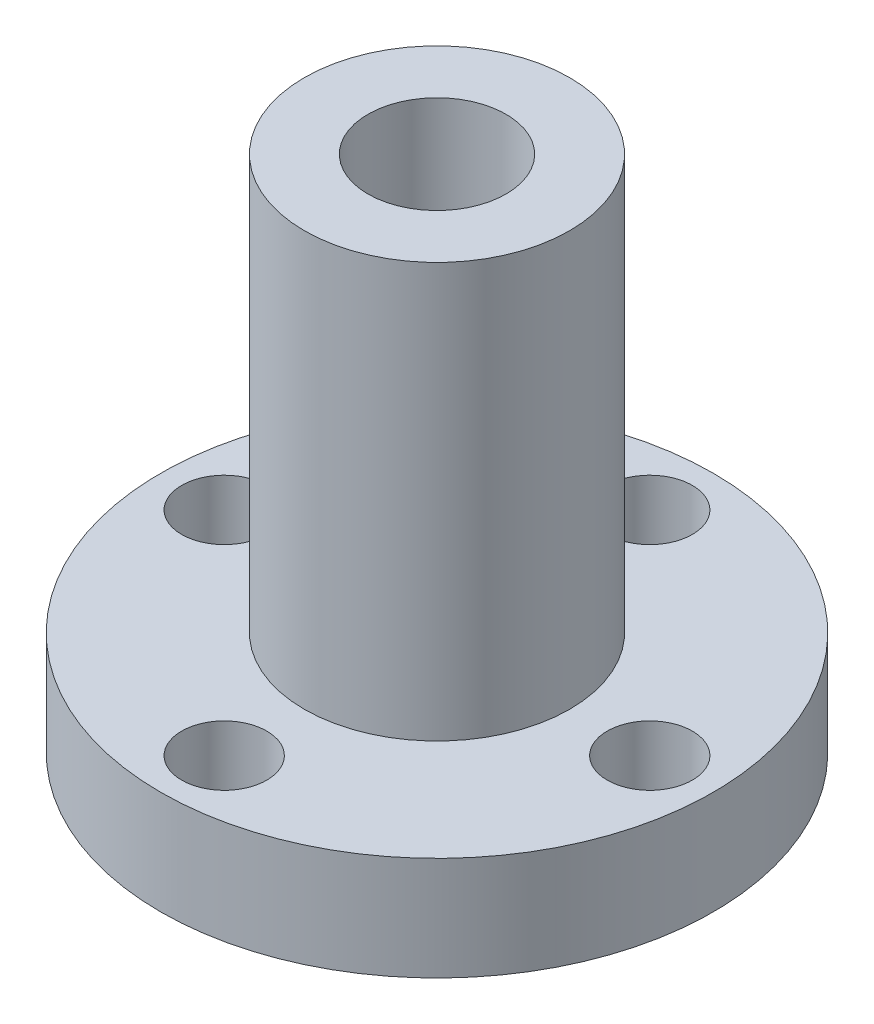
ISO-10303-21;
HEADER;
FILE_DESCRIPTION(('STEP AP214'),'2;1');
FILE_NAME('part.step','',(''),(''),'','','');
FILE_SCHEMA(('AUTOMOTIVE_DESIGN { 1 0 10303 214 1 1 1 1 }'));
ENDSEC;
DATA;
#1=APPLICATION_CONTEXT('core data for automotive mechanical design processes');
#2=APPLICATION_PROTOCOL_DEFINITION('international standard','automotive_design',2000,#1);
#3=PRODUCT_CONTEXT('',#1,'mechanical');
#4=PRODUCT('Part','Part','',(#3));
#5=PRODUCT_RELATED_PRODUCT_CATEGORY('part','',(#4));
#6=PRODUCT_DEFINITION_FORMATION('','',#4);
#7=PRODUCT_DEFINITION_CONTEXT('part definition',#1,'design');
#8=PRODUCT_DEFINITION('design','',#6,#7);
#9=PRODUCT_DEFINITION_SHAPE('','',#8);
#10=(LENGTH_UNIT() NAMED_UNIT(*) SI_UNIT(.MILLI.,.METRE.));
#11=(NAMED_UNIT(*) PLANE_ANGLE_UNIT() SI_UNIT($,.RADIAN.));
#12=(NAMED_UNIT(*) SI_UNIT($,.STERADIAN.) SOLID_ANGLE_UNIT());
#13=UNCERTAINTY_MEASURE_WITH_UNIT(LENGTH_MEASURE(1.E-05),#10,'distance_accuracy_value','');
#14=(GEOMETRIC_REPRESENTATION_CONTEXT(3) GLOBAL_UNCERTAINTY_ASSIGNED_CONTEXT((#13)) GLOBAL_UNIT_ASSIGNED_CONTEXT((#10,
#11,#12)) REPRESENTATION_CONTEXT('',''));
#15=CARTESIAN_POINT('',(0.,0.,0.));
#16=DIRECTION('',(0.,0.,1.));
#17=DIRECTION('',(1.,0.,0.));
#18=AXIS2_PLACEMENT_3D('',#15,#16,#17);
#19=CARTESIAN_POINT('',(0.,-4.7625,0.));
#20=DIRECTION('',(0.,1.,0.));
#21=DIRECTION('',(0.,0.,1.));
#22=AXIS2_PLACEMENT_3D('',#19,#20,#21);
#23=CYLINDRICAL_SURFACE('',#22,12.7);
#24=CARTESIAN_POINT('',(0.,-4.7625,0.));
#25=DIRECTION('',(0.,1.,0.));
#26=DIRECTION('',(0.,0.,1.));
#27=AXIS2_PLACEMENT_3D('',#24,#25,#26);
#28=CIRCLE('',#27,12.7);
#29=CARTESIAN_POINT('',(0.,-4.7625,12.7));
#30=VERTEX_POINT('',#29);
#31=EDGE_CURVE('E42',#30,#30,#28,.T.);
#32=ORIENTED_EDGE('',*,*,#31,.T.);
#33=EDGE_LOOP('',(#32));
#34=FACE_BOUND('',#33,.T.);
#35=CARTESIAN_POINT('',(0.,0.,0.));
#36=DIRECTION('',(0.,1.,0.));
#37=DIRECTION('',(0.,0.,1.));
#38=AXIS2_PLACEMENT_3D('',#35,#36,#37);
#39=CIRCLE('',#38,12.7);
#40=CARTESIAN_POINT('',(0.,0.,12.7));
#41=VERTEX_POINT('',#40);
#42=EDGE_CURVE('E38',#41,#41,#39,.T.);
#43=ORIENTED_EDGE('',*,*,#42,.F.);
#44=EDGE_LOOP('',(#43));
#45=FACE_BOUND('',#44,.T.);
#46=ADVANCED_FACE('F34',(#34,#45),#23,.T.);
#47=CARTESIAN_POINT('',(0.,-4.7625,-9.779));
#48=DIRECTION('',(0.,1.,0.));
#49=DIRECTION('',(0.,0.,1.));
#50=AXIS2_PLACEMENT_3D('',#47,#48,#49);
#51=CYLINDRICAL_SURFACE('',#50,1.9558);
#52=CARTESIAN_POINT('',(0.,-4.7625,-9.779));
#53=DIRECTION('',(0.,1.,0.));
#54=DIRECTION('',(0.,0.,1.));
#55=AXIS2_PLACEMENT_3D('',#52,#53,#54);
#56=CIRCLE('',#55,1.9558);
#57=CARTESIAN_POINT('',(0.,-4.7625,-7.8232));
#58=VERTEX_POINT('',#57);
#59=EDGE_CURVE('E47',#58,#58,#56,.T.);
#60=ORIENTED_EDGE('',*,*,#59,.F.);
#61=EDGE_LOOP('',(#60));
#62=FACE_BOUND('',#61,.T.);
#63=CARTESIAN_POINT('',(0.,0.,-9.779));
#64=DIRECTION('',(0.,1.,0.));
#65=DIRECTION('',(0.,0.,1.));
#66=AXIS2_PLACEMENT_3D('',#63,#64,#65);
#67=CIRCLE('',#66,1.9558);
#68=CARTESIAN_POINT('',(0.,0.,-7.8232));
#69=VERTEX_POINT('',#68);
#70=EDGE_CURVE('E60',#69,#69,#67,.T.);
#71=ORIENTED_EDGE('',*,*,#70,.T.);
#72=EDGE_LOOP('',(#71));
#73=FACE_BOUND('',#72,.T.);
#74=ADVANCED_FACE('F87',(#62,#73),#51,.F.);
#75=CARTESIAN_POINT('',(9.779,-4.7625,0.));
#76=DIRECTION('',(0.,1.,0.));
#77=DIRECTION('',(0.,0.,1.));
#78=AXIS2_PLACEMENT_3D('',#75,#76,#77);
#79=CYLINDRICAL_SURFACE('',#78,1.9558);
#80=CARTESIAN_POINT('',(9.779,-4.7625,0.));
#81=DIRECTION('',(0.,1.,0.));
#82=DIRECTION('',(0.,0.,1.));
#83=AXIS2_PLACEMENT_3D('',#80,#81,#82);
#84=CIRCLE('',#83,1.9558);
#85=CARTESIAN_POINT('',(9.779,-4.7625,1.9558));
#86=VERTEX_POINT('',#85);
#87=EDGE_CURVE('E74',#86,#86,#84,.T.);
#88=ORIENTED_EDGE('',*,*,#87,.F.);
#89=EDGE_LOOP('',(#88));
#90=FACE_BOUND('',#89,.T.);
#91=CARTESIAN_POINT('',(9.779,0.,0.));
#92=DIRECTION('',(0.,1.,0.));
#93=DIRECTION('',(0.,0.,1.));
#94=AXIS2_PLACEMENT_3D('',#91,#92,#93);
#95=CIRCLE('',#94,1.9558);
#96=CARTESIAN_POINT('',(9.779,0.,1.9558));
#97=VERTEX_POINT('',#96);
#98=EDGE_CURVE('E58',#97,#97,#95,.T.);
#99=ORIENTED_EDGE('',*,*,#98,.T.);
#100=EDGE_LOOP('',(#99));
#101=FACE_BOUND('',#100,.T.);
#102=ADVANCED_FACE('F89',(#90,#101),#79,.F.);
#103=CARTESIAN_POINT('',(0.,-4.7625,9.779));
#104=DIRECTION('',(0.,1.,0.));
#105=DIRECTION('',(0.,0.,1.));
#106=AXIS2_PLACEMENT_3D('',#103,#104,#105);
#107=CYLINDRICAL_SURFACE('',#106,1.9558);
#108=CARTESIAN_POINT('',(0.,-4.7625,9.779));
#109=DIRECTION('',(0.,1.,0.));
#110=DIRECTION('',(0.,0.,1.));
#111=AXIS2_PLACEMENT_3D('',#108,#109,#110);
#112=CIRCLE('',#111,1.9558);
#113=CARTESIAN_POINT('',(0.,-4.7625,11.7348));
#114=VERTEX_POINT('',#113);
#115=EDGE_CURVE('E69',#114,#114,#112,.T.);
#116=ORIENTED_EDGE('',*,*,#115,.F.);
#117=EDGE_LOOP('',(#116));
#118=FACE_BOUND('',#117,.T.);
#119=CARTESIAN_POINT('',(0.,0.,9.779));
#120=DIRECTION('',(0.,1.,0.));
#121=DIRECTION('',(0.,0.,1.));
#122=AXIS2_PLACEMENT_3D('',#119,#120,#121);
#123=CIRCLE('',#122,1.9558);
#124=CARTESIAN_POINT('',(0.,0.,11.7348));
#125=VERTEX_POINT('',#124);
#126=EDGE_CURVE('E54',#125,#125,#123,.T.);
#127=ORIENTED_EDGE('',*,*,#126,.T.);
#128=EDGE_LOOP('',(#127));
#129=FACE_BOUND('',#128,.T.);
#130=ADVANCED_FACE('F95',(#118,#129),#107,.F.);
#131=CARTESIAN_POINT('',(-9.779,-4.7625,0.));
#132=DIRECTION('',(0.,1.,0.));
#133=DIRECTION('',(0.,0.,1.));
#134=AXIS2_PLACEMENT_3D('',#131,#132,#133);
#135=CYLINDRICAL_SURFACE('',#134,1.9558);
#136=CARTESIAN_POINT('',(-9.779,-4.7625,0.));
#137=DIRECTION('',(0.,1.,0.));
#138=DIRECTION('',(0.,0.,1.));
#139=AXIS2_PLACEMENT_3D('',#136,#137,#138);
#140=CIRCLE('',#139,1.9558);
#141=CARTESIAN_POINT('',(-9.779,-4.7625,1.9558));
#142=VERTEX_POINT('',#141);
#143=EDGE_CURVE('E65',#142,#142,#140,.T.);
#144=ORIENTED_EDGE('',*,*,#143,.F.);
#145=EDGE_LOOP('',(#144));
#146=FACE_BOUND('',#145,.T.);
#147=CARTESIAN_POINT('',(-9.779,0.,0.));
#148=DIRECTION('',(0.,1.,0.));
#149=DIRECTION('',(0.,0.,1.));
#150=AXIS2_PLACEMENT_3D('',#147,#148,#149);
#151=CIRCLE('',#150,1.9558);
#152=CARTESIAN_POINT('',(-9.779,0.,1.9558));
#153=VERTEX_POINT('',#152);
#154=EDGE_CURVE('E51',#153,#153,#151,.T.);
#155=ORIENTED_EDGE('',*,*,#154,.T.);
#156=EDGE_LOOP('',(#155));
#157=FACE_BOUND('',#156,.T.);
#158=ADVANCED_FACE('F36',(#146,#157),#135,.F.);
#159=CARTESIAN_POINT('',(0.,-4.7625,0.));
#160=DIRECTION('',(0.,1.,0.));
#161=DIRECTION('',(0.,0.,1.));
#162=AXIS2_PLACEMENT_3D('',#159,#160,#161);
#163=CYLINDRICAL_SURFACE('',#162,3.175);
#164=CARTESIAN_POINT('',(0.,-4.7625,0.));
#165=DIRECTION('',(0.,1.,0.));
#166=DIRECTION('',(0.,0.,1.));
#167=AXIS2_PLACEMENT_3D('',#164,#165,#166);
#168=CIRCLE('',#167,3.175);
#169=CARTESIAN_POINT('',(0.,-4.7625,3.175));
#170=VERTEX_POINT('',#169);
#171=EDGE_CURVE('E10',#170,#170,#168,.T.);
#172=ORIENTED_EDGE('',*,*,#171,.F.);
#173=EDGE_LOOP('',(#172));
#174=FACE_BOUND('',#173,.T.);
#175=CARTESIAN_POINT('',(0.,19.05,0.));
#176=DIRECTION('',(0.,1.,0.));
#177=DIRECTION('',(0.,0.,1.));
#178=AXIS2_PLACEMENT_3D('',#175,#176,#177);
#179=CIRCLE('',#178,3.175);
#180=CARTESIAN_POINT('',(0.,19.05,3.175));
#181=VERTEX_POINT('',#180);
#182=EDGE_CURVE('E138',#181,#181,#179,.T.);
#183=ORIENTED_EDGE('',*,*,#182,.T.);
#184=EDGE_LOOP('',(#183));
#185=FACE_BOUND('',#184,.T.);
#186=ADVANCED_FACE('F106',(#174,#185),#163,.F.);
#187=CARTESIAN_POINT('',(0.,-4.7625,0.));
#188=DIRECTION('',(0.,1.,0.));
#189=DIRECTION('',(0.,0.,1.));
#190=AXIS2_PLACEMENT_3D('',#187,#188,#189);
#191=PLANE('',#190);
#192=ORIENTED_EDGE('',*,*,#143,.T.);
#193=EDGE_LOOP('',(#192));
#194=FACE_BOUND('',#193,.T.);
#195=ORIENTED_EDGE('',*,*,#115,.T.);
#196=EDGE_LOOP('',(#195));
#197=FACE_BOUND('',#196,.T.);
#198=ORIENTED_EDGE('',*,*,#87,.T.);
#199=EDGE_LOOP('',(#198));
#200=FACE_BOUND('',#199,.T.);
#201=ORIENTED_EDGE('',*,*,#59,.T.);
#202=EDGE_LOOP('',(#201));
#203=FACE_BOUND('',#202,.T.);
#204=ORIENTED_EDGE('',*,*,#31,.F.);
#205=EDGE_LOOP('',(#204));
#206=FACE_BOUND('',#205,.T.);
#207=ORIENTED_EDGE('',*,*,#171,.T.);
#208=EDGE_LOOP('',(#207));
#209=FACE_BOUND('',#208,.T.);
#210=ADVANCED_FACE('F84',(#194,#197,#200,#203,#206,#209),#191,.F.);
#211=CARTESIAN_POINT('',(0.,0.,0.));
#212=DIRECTION('',(0.,1.,0.));
#213=DIRECTION('',(0.,0.,1.));
#214=AXIS2_PLACEMENT_3D('',#211,#212,#213);
#215=PLANE('',#214);
#216=CARTESIAN_POINT('',(0.,0.,0.));
#217=DIRECTION('',(0.,1.,0.));
#218=DIRECTION('',(0.,0.,1.));
#219=AXIS2_PLACEMENT_3D('',#216,#217,#218);
#220=CIRCLE('',#219,6.096);
#221=CARTESIAN_POINT('',(0.,0.,6.096));
#222=VERTEX_POINT('',#221);
#223=EDGE_CURVE('E77',#222,#222,#220,.T.);
#224=ORIENTED_EDGE('',*,*,#223,.F.);
#225=EDGE_LOOP('',(#224));
#226=FACE_BOUND('',#225,.T.);
#227=ORIENTED_EDGE('',*,*,#154,.F.);
#228=EDGE_LOOP('',(#227));
#229=FACE_BOUND('',#228,.T.);
#230=ORIENTED_EDGE('',*,*,#126,.F.);
#231=EDGE_LOOP('',(#230));
#232=FACE_BOUND('',#231,.T.);
#233=ORIENTED_EDGE('',*,*,#98,.F.);
#234=EDGE_LOOP('',(#233));
#235=FACE_BOUND('',#234,.T.);
#236=ORIENTED_EDGE('',*,*,#70,.F.);
#237=EDGE_LOOP('',(#236));
#238=FACE_BOUND('',#237,.T.);
#239=ORIENTED_EDGE('',*,*,#42,.T.);
#240=EDGE_LOOP('',(#239));
#241=FACE_BOUND('',#240,.T.);
#242=ADVANCED_FACE('F112',(#226,#229,#232,#235,#238,#241),#215,.T.);
#243=CARTESIAN_POINT('',(0.,19.05,0.));
#244=DIRECTION('',(0.,-1.,0.));
#245=DIRECTION('',(0.,0.,-1.));
#246=AXIS2_PLACEMENT_3D('',#243,#244,#245);
#247=CYLINDRICAL_SURFACE('',#246,6.096);
#248=CARTESIAN_POINT('',(0.,19.05,0.));
#249=DIRECTION('',(0.,1.,0.));
#250=DIRECTION('',(0.,0.,1.));
#251=AXIS2_PLACEMENT_3D('',#248,#249,#250);
#252=CIRCLE('',#251,6.096);
#253=CARTESIAN_POINT('',(0.,19.05,6.096));
#254=VERTEX_POINT('',#253);
#255=EDGE_CURVE('E55',#254,#254,#252,.T.);
#256=ORIENTED_EDGE('',*,*,#255,.F.);
#257=EDGE_LOOP('',(#256));
#258=FACE_BOUND('',#257,.T.);
#259=ORIENTED_EDGE('',*,*,#223,.T.);
#260=EDGE_LOOP('',(#259));
#261=FACE_BOUND('',#260,.T.);
#262=ADVANCED_FACE('F115',(#258,#261),#247,.T.);
#263=CARTESIAN_POINT('',(0.,19.05,0.));
#264=DIRECTION('',(0.,1.,0.));
#265=DIRECTION('',(0.,0.,1.));
#266=AXIS2_PLACEMENT_3D('',#263,#264,#265);
#267=PLANE('',#266);
#268=ORIENTED_EDGE('',*,*,#182,.F.);
#269=EDGE_LOOP('',(#268));
#270=FACE_BOUND('',#269,.T.);
#271=ORIENTED_EDGE('',*,*,#255,.T.);
#272=EDGE_LOOP('',(#271));
#273=FACE_BOUND('',#272,.T.);
#274=ADVANCED_FACE('F125',(#270,#273),#267,.T.);
#275=CLOSED_SHELL('',(#46,#74,#102,#130,#158,#186,#210,#242,#262,#274));
#276=MANIFOLD_SOLID_BREP('B2',#275);
#277=ADVANCED_BREP_SHAPE_REPRESENTATION('',(#18,#276),#14);
#278=SHAPE_DEFINITION_REPRESENTATION(#9,#277);
ENDSEC;
END-ISO-10303-21;
